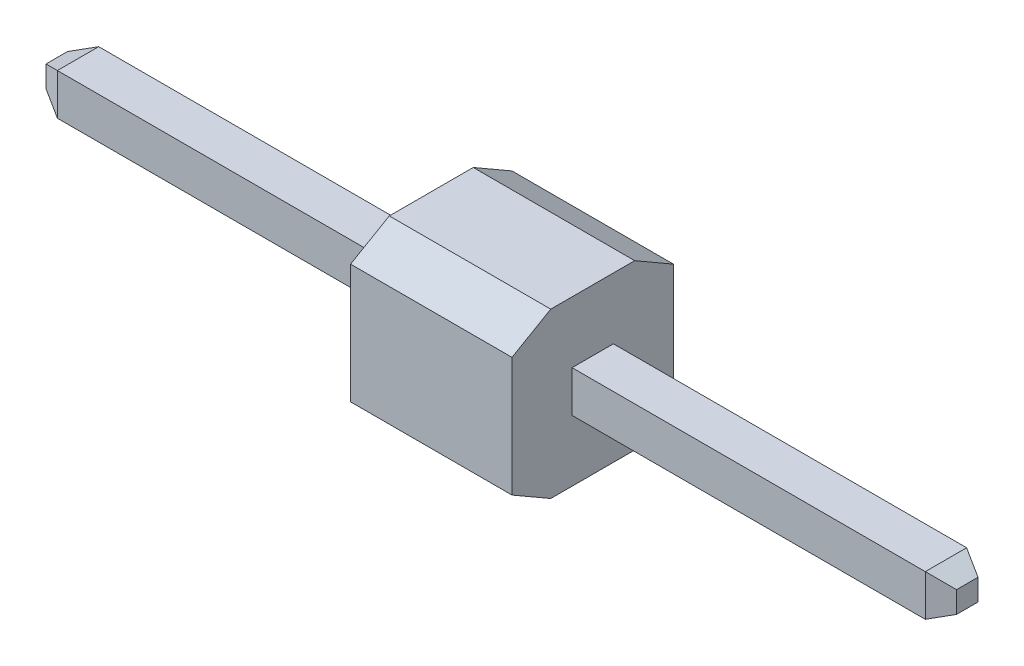
ISO-10303-21;
HEADER;
FILE_DESCRIPTION(('STEP AP214'),'2;1');
FILE_NAME('part.step','',(''),(''),'','','');
FILE_SCHEMA(('AUTOMOTIVE_DESIGN { 1 0 10303 214 1 1 1 1 }'));
ENDSEC;
DATA;
#1=APPLICATION_CONTEXT('core data for automotive mechanical design processes');
#2=APPLICATION_PROTOCOL_DEFINITION('international standard','automotive_design',2000,#1);
#3=PRODUCT_CONTEXT('',#1,'mechanical');
#4=PRODUCT('Part','Part','',(#3));
#5=PRODUCT_RELATED_PRODUCT_CATEGORY('part','',(#4));
#6=PRODUCT_DEFINITION_FORMATION('','',#4);
#7=PRODUCT_DEFINITION_CONTEXT('part definition',#1,'design');
#8=PRODUCT_DEFINITION('design','',#6,#7);
#9=PRODUCT_DEFINITION_SHAPE('','',#8);
#10=(LENGTH_UNIT() NAMED_UNIT(*) SI_UNIT(.MILLI.,.METRE.));
#11=(NAMED_UNIT(*) PLANE_ANGLE_UNIT() SI_UNIT($,.RADIAN.));
#12=(NAMED_UNIT(*) SI_UNIT($,.STERADIAN.) SOLID_ANGLE_UNIT());
#13=UNCERTAINTY_MEASURE_WITH_UNIT(LENGTH_MEASURE(1.E-05),#10,'distance_accuracy_value','');
#14=(GEOMETRIC_REPRESENTATION_CONTEXT(3) GLOBAL_UNCERTAINTY_ASSIGNED_CONTEXT((#13)) GLOBAL_UNIT_ASSIGNED_CONTEXT((#10,
#11,#12)) REPRESENTATION_CONTEXT('',''));
#15=CARTESIAN_POINT('',(0.,0.,0.));
#16=DIRECTION('',(0.,0.,1.));
#17=DIRECTION('',(1.,0.,0.));
#18=AXIS2_PLACEMENT_3D('',#15,#16,#17);
#19=CARTESIAN_POINT('',(5.42110070000193,2.85711572605714,-2.77112081761862));
#20=DIRECTION('',(1.,-9.93476518829084E-08,4.37113882867379E-08));
#21=DIRECTION('',(-9.93476589883358E-08,-1.,8.74227765734759E-08));
#22=AXIS2_PLACEMENT_3D('',#19,#20,#21);
#23=PLANE('',#22);
#24=DIRECTION('',(-1.18186632779335E-08,-0.50000007571054,-0.866025360072933));
#25=VECTOR('',#24,1.);
#26=CARTESIAN_POINT('',(5.42110050782732,1.61352602482091,-1.20112070890054));
#27=LINE('',#26,#25);
#28=CARTESIAN_POINT('',(5.42110050782732,1.61352602482091,-1.20112070890054));
#29=VERTEX_POINT('',#28);
#30=CARTESIAN_POINT('',(5.42110049963911,1.26711581085724,-1.8011206786164));
#31=VERTEX_POINT('',#30);
#32=EDGE_CURVE('E11',#29,#31,#27,.T.);
#33=ORIENTED_EDGE('',*,*,#32,.T.);
#34=DIRECTION('',(4.37113811813104E-08,-8.74227828590458E-08,-0.999999999999995));
#35=VECTOR('',#34,1.);
#36=CARTESIAN_POINT('',(5.42110049963911,1.26711581085724,-1.8011206786164));
#37=LINE('',#36,#35);
#38=CARTESIAN_POINT('',(5.4211005564639,1.26711569720762,-3.1011206786164));
#39=VERTEX_POINT('',#38);
#40=EDGE_CURVE('E304',#31,#39,#37,.T.);
#41=ORIENTED_EDGE('',*,*,#40,.T.);
#42=DIRECTION('',(8.75289963531795E-08,0.499999924289837,-0.866025447495713));
#43=VECTOR('',#42,1.);
#44=CARTESIAN_POINT('',(5.4211005564639,1.26711569720762,-3.1011206786164));
#45=LINE('',#44,#43);
#46=CARTESIAN_POINT('',(5.42110061710577,1.61352580626395,-3.70112070890054));
#47=VERTEX_POINT('',#46);
#48=EDGE_CURVE('E296',#39,#47,#45,.T.);
#49=ORIENTED_EDGE('',*,*,#48,.T.);
#50=DIRECTION('',(9.93476588436478E-08,0.999999999999991,-8.74227764822788E-08));
#51=VECTOR('',#50,1.);
#52=CARTESIAN_POINT('',(5.42110061710577,1.61352580626395,-3.70112070890054));
#53=LINE('',#52,#51);
#54=CARTESIAN_POINT('',(5.42110080061875,3.46070548323395,-3.70112087038612));
#55=VERTEX_POINT('',#54);
#56=EDGE_CURVE('E281',#47,#55,#53,.T.);
#57=ORIENTED_EDGE('',*,*,#56,.T.);
#58=DIRECTION('',(-1.18186619958731E-08,-0.500000075710537,-0.866025360072935));
#59=VECTOR('',#58,1.);
#60=CARTESIAN_POINT('',(5.42110080880696,3.80711569720762,-3.10112090067026));
#61=LINE('',#60,#59);
#62=CARTESIAN_POINT('',(5.42110080880696,3.80711569720762,-3.10112090067026));
#63=VERTEX_POINT('',#62);
#64=EDGE_CURVE('E265',#63,#55,#61,.T.);
#65=ORIENTED_EDGE('',*,*,#64,.F.);
#66=DIRECTION('',(4.37113811813104E-08,-8.74227814926175E-08,-0.999999999999995));
#67=VECTOR('',#66,1.);
#68=CARTESIAN_POINT('',(5.42110075198216,3.80711581085724,-1.80112090067026));
#69=LINE('',#68,#67);
#70=CARTESIAN_POINT('',(5.42110075198216,3.80711581085724,-1.80112090067026));
#71=VERTEX_POINT('',#70);
#72=EDGE_CURVE('E248',#71,#63,#69,.T.);
#73=ORIENTED_EDGE('',*,*,#72,.F.);
#74=DIRECTION('',(8.75289963525478E-08,0.499999924289836,-0.866025447495714));
#75=VECTOR('',#74,1.);
#76=CARTESIAN_POINT('',(5.4211006913403,3.46070570179091,-1.20112087038612));
#77=LINE('',#76,#75);
#78=CARTESIAN_POINT('',(5.4211006913403,3.46070570179091,-1.20112087038612));
#79=VERTEX_POINT('',#78);
#80=EDGE_CURVE('E242',#79,#71,#77,.T.);
#81=ORIENTED_EDGE('',*,*,#80,.F.);
#82=DIRECTION('',(9.93476588436478E-08,0.999999999999991,-8.74227763620714E-08));
#83=VECTOR('',#82,1.);
#84=CARTESIAN_POINT('',(5.42110050782732,1.61352602482091,-1.20112070890054));
#85=LINE('',#84,#83);
#86=EDGE_CURVE('E236',#29,#79,#85,.T.);
#87=ORIENTED_EDGE('',*,*,#86,.F.);
#88=EDGE_LOOP('',(#33,#41,#49,#57,#65,#73,#81,#87));
#89=FACE_BOUND('',#88,.T.);
#90=DIRECTION('',(-4.37113817364219E-08,8.74227801261891E-08,0.999999999999995));
#91=VECTOR('',#90,1.);
#92=CARTESIAN_POINT('',(5.42110063641942,2.21711572605714,-2.77112076166804));
#93=LINE('',#92,#91);
#94=CARTESIAN_POINT('',(5.42110063641942,2.21711572605714,-2.77112076166804));
#95=VERTEX_POINT('',#94);
#96=CARTESIAN_POINT('',(5.42110060844414,2.21711578200772,-2.13112076166804));
#97=VERTEX_POINT('',#96);
#98=EDGE_CURVE('E302',#95,#97,#93,.T.);
#99=ORIENTED_EDGE('',*,*,#98,.T.);
#100=DIRECTION('',(-9.93476592658908E-08,-0.999999999999991,8.7422776656742E-08));
#101=VECTOR('',#100,1.);
#102=CARTESIAN_POINT('',(5.42110067202664,2.85711578200772,-2.13112081761862));
#103=LINE('',#102,#101);
#104=CARTESIAN_POINT('',(5.42110067202664,2.85711578200772,-2.13112081761862));
#105=VERTEX_POINT('',#104);
#106=EDGE_CURVE('E293',#105,#97,#103,.T.);
#107=ORIENTED_EDGE('',*,*,#106,.F.);
#108=DIRECTION('',(-4.37113817364219E-08,8.74227829017466E-08,0.999999999999995));
#109=VECTOR('',#108,1.);
#110=CARTESIAN_POINT('',(5.42110070000193,2.85711572605714,-2.77112081761862));
#111=LINE('',#110,#109);
#112=CARTESIAN_POINT('',(5.42110070000193,2.85711572605714,-2.77112081761862));
#113=VERTEX_POINT('',#112);
#114=EDGE_CURVE('E278',#113,#105,#111,.T.);
#115=ORIENTED_EDGE('',*,*,#114,.F.);
#116=DIRECTION('',(-9.93476592658908E-08,-0.999999999999991,8.7422776656742E-08));
#117=VECTOR('',#116,1.);
#118=CARTESIAN_POINT('',(5.42110070000193,2.85711572605714,-2.77112081761862));
#119=LINE('',#118,#117);
#120=EDGE_CURVE('E263',#113,#95,#119,.T.);
#121=ORIENTED_EDGE('',*,*,#120,.T.);
#122=EDGE_LOOP('',(#99,#107,#115,#121));
#123=FACE_BOUND('',#122,.T.);
#124=ADVANCED_FACE('F17',(#89,#123),#23,.T.);
#125=CARTESIAN_POINT('',(2.92110070000193,2.85711597442627,-2.77112092689709));
#126=DIRECTION('',(1.,-9.93476518829084E-08,4.37113882867379E-08));
#127=DIRECTION('',(-9.93476589883358E-08,-1.,8.74227765734759E-08));
#128=AXIS2_PLACEMENT_3D('',#125,#126,#127);
#129=PLANE('',#128);
#130=DIRECTION('',(-1.18186632779335E-08,-0.50000007571054,-0.866025360072933));
#131=VECTOR('',#130,1.);
#132=CARTESIAN_POINT('',(2.92110050782732,1.61352627319004,-1.20112081817901));
#133=LINE('',#132,#131);
#134=CARTESIAN_POINT('',(2.92110050782732,1.61352627319004,-1.20112081817901));
#135=VERTEX_POINT('',#134);
#136=CARTESIAN_POINT('',(2.92110049963911,1.26711605922637,-1.80112078789487));
#137=VERTEX_POINT('',#136);
#138=EDGE_CURVE('E24',#135,#137,#133,.T.);
#139=ORIENTED_EDGE('',*,*,#138,.F.);
#140=DIRECTION('',(9.93476588436478E-08,0.999999999999991,-8.74227763620714E-08));
#141=VECTOR('',#140,1.);
#142=CARTESIAN_POINT('',(2.92110050782732,1.61352627319004,-1.20112081817901));
#143=LINE('',#142,#141);
#144=CARTESIAN_POINT('',(2.9211006913403,3.46070595016004,-1.20112097966459));
#145=VERTEX_POINT('',#144);
#146=EDGE_CURVE('E300',#135,#145,#143,.T.);
#147=ORIENTED_EDGE('',*,*,#146,.T.);
#148=DIRECTION('',(8.75289963525478E-08,0.499999924289836,-0.866025447495714));
#149=VECTOR('',#148,1.);
#150=CARTESIAN_POINT('',(2.9211006913403,3.46070595016004,-1.20112097966459));
#151=LINE('',#150,#149);
#152=CARTESIAN_POINT('',(2.92110075198216,3.80711605922637,-1.80112100994873));
#153=VERTEX_POINT('',#152);
#154=EDGE_CURVE('E286',#145,#153,#151,.T.);
#155=ORIENTED_EDGE('',*,*,#154,.T.);
#156=DIRECTION('',(4.37113811813104E-08,-8.74227814926175E-08,-0.999999999999995));
#157=VECTOR('',#156,1.);
#158=CARTESIAN_POINT('',(2.92110075198216,3.80711605922637,-1.80112100994873));
#159=LINE('',#158,#157);
#160=CARTESIAN_POINT('',(2.92110080880696,3.80711594557675,-3.10112100994873));
#161=VERTEX_POINT('',#160);
#162=EDGE_CURVE('E271',#153,#161,#159,.T.);
#163=ORIENTED_EDGE('',*,*,#162,.T.);
#164=DIRECTION('',(-1.18186626368607E-08,-0.500000075710537,-0.866025360072935));
#165=VECTOR('',#164,1.);
#166=CARTESIAN_POINT('',(2.92110080880696,3.80711594557675,-3.10112100994873));
#167=LINE('',#166,#165);
#168=CARTESIAN_POINT('',(2.92110080061875,3.46070573160308,-3.70112097966459));
#169=VERTEX_POINT('',#168);
#170=EDGE_CURVE('E253',#161,#169,#167,.T.);
#171=ORIENTED_EDGE('',*,*,#170,.T.);
#172=DIRECTION('',(9.93476588436478E-08,0.999999999999991,-8.74227764822788E-08));
#173=VECTOR('',#172,1.);
#174=CARTESIAN_POINT('',(2.92110061710577,1.61352605463308,-3.70112081817901));
#175=LINE('',#174,#173);
#176=CARTESIAN_POINT('',(2.92110061710577,1.61352605463308,-3.70112081817901));
#177=VERTEX_POINT('',#176);
#178=EDGE_CURVE('E261',#177,#169,#175,.T.);
#179=ORIENTED_EDGE('',*,*,#178,.F.);
#180=DIRECTION('',(8.75289963531795E-08,0.499999924289837,-0.866025447495713));
#181=VECTOR('',#180,1.);
#182=CARTESIAN_POINT('',(2.9211005564639,1.26711594557675,-3.10112078789487));
#183=LINE('',#182,#181);
#184=CARTESIAN_POINT('',(2.9211005564639,1.26711594557675,-3.10112078789487));
#185=VERTEX_POINT('',#184);
#186=EDGE_CURVE('E276',#185,#177,#183,.T.);
#187=ORIENTED_EDGE('',*,*,#186,.F.);
#188=DIRECTION('',(4.37113811813104E-08,-8.74227828590458E-08,-0.999999999999995));
#189=VECTOR('',#188,1.);
#190=CARTESIAN_POINT('',(2.92110049963911,1.26711605922637,-1.80112078789487));
#191=LINE('',#190,#189);
#192=EDGE_CURVE('E291',#137,#185,#191,.T.);
#193=ORIENTED_EDGE('',*,*,#192,.F.);
#194=EDGE_LOOP('',(#139,#147,#155,#163,#171,#179,#187,#193));
#195=FACE_BOUND('',#194,.T.);
#196=DIRECTION('',(-9.93476585720014E-08,-0.999999999999991,8.7422776656742E-08));
#197=VECTOR('',#196,1.);
#198=CARTESIAN_POINT('',(2.92110067202664,2.85711603037685,-2.13112092689709));
#199=LINE('',#198,#197);
#200=CARTESIAN_POINT('',(2.92110067202664,2.85711603037685,-2.13112092689709));
#201=VERTEX_POINT('',#200);
#202=CARTESIAN_POINT('',(2.92110060844414,2.21711603037685,-2.13112087094651));
#203=VERTEX_POINT('',#202);
#204=EDGE_CURVE('E298',#201,#203,#199,.T.);
#205=ORIENTED_EDGE('',*,*,#204,.T.);
#206=DIRECTION('',(-4.37113810425325E-08,8.74227801261891E-08,0.999999999999995));
#207=VECTOR('',#206,1.);
#208=CARTESIAN_POINT('',(2.92110063641942,2.21711597442627,-2.77112087094651));
#209=LINE('',#208,#207);
#210=CARTESIAN_POINT('',(2.92110063641942,2.21711597442627,-2.77112087094651));
#211=VERTEX_POINT('',#210);
#212=EDGE_CURVE('E283',#211,#203,#209,.T.);
#213=ORIENTED_EDGE('',*,*,#212,.F.);
#214=DIRECTION('',(-9.93476592658908E-08,-0.999999999999991,8.7422776656742E-08));
#215=VECTOR('',#214,1.);
#216=CARTESIAN_POINT('',(2.92110070000193,2.85711597442627,-2.77112092689709));
#217=LINE('',#216,#215);
#218=CARTESIAN_POINT('',(2.92110070000193,2.85711597442627,-2.77112092689709));
#219=VERTEX_POINT('',#218);
#220=EDGE_CURVE('E268',#219,#211,#217,.T.);
#221=ORIENTED_EDGE('',*,*,#220,.F.);
#222=DIRECTION('',(-4.37113817364219E-08,8.74227829017466E-08,0.999999999999995));
#223=VECTOR('',#222,1.);
#224=CARTESIAN_POINT('',(2.92110070000193,2.85711597442627,-2.77112092689709));
#225=LINE('',#224,#223);
#226=EDGE_CURVE('E251',#219,#201,#225,.T.);
#227=ORIENTED_EDGE('',*,*,#226,.T.);
#228=EDGE_LOOP('',(#205,#213,#221,#227));
#229=FACE_BOUND('',#228,.T.);
#230=ADVANCED_FACE('F314',(#195,#229),#129,.F.);
#231=CARTESIAN_POINT('',(5.42110050782732,1.61352602482091,-1.20112070890054));
#232=DIRECTION('',(1.07893287081065E-07,0.866025360072937,-0.500000075710535));
#233=DIRECTION('',(1.18186629566715E-08,0.500000075710542,0.866025360072941));
#234=AXIS2_PLACEMENT_3D('',#231,#232,#233);
#235=PLANE('',#234);
#236=ORIENTED_EDGE('',*,*,#138,.T.);
#237=DIRECTION('',(-0.999999999999994,9.93476511723651E-08,-4.37113884643734E-08));
#238=VECTOR('',#237,1.);
#239=CARTESIAN_POINT('',(5.42110049963911,1.26711581085724,-1.8011206786164));
#240=LINE('',#239,#238);
#241=EDGE_CURVE('E288',#31,#137,#240,.T.);
#242=ORIENTED_EDGE('',*,*,#241,.F.);
#243=ORIENTED_EDGE('',*,*,#32,.F.);
#244=DIRECTION('',(-0.999999999999994,9.93476518829078E-08,-4.3711388109102E-08));
#245=VECTOR('',#244,1.);
#246=CARTESIAN_POINT('',(5.42110050782732,1.61352602482091,-1.20112070890054));
#247=LINE('',#246,#245);
#248=EDGE_CURVE('E256',#29,#135,#247,.T.);
#249=ORIENTED_EDGE('',*,*,#248,.T.);
#250=EDGE_LOOP('',(#236,#242,#243,#249));
#251=FACE_BOUND('',#250,.T.);
#252=ADVANCED_FACE('F306',(#251),#235,.F.);
#253=CARTESIAN_POINT('',(5.42110049963911,1.26711581085724,-1.8011206786164));
#254=DIRECTION('',(9.93476589883358E-08,1.,-8.74227765734759E-08));
#255=DIRECTION('',(1.,-9.93476518829084E-08,4.37113882867379E-08));
#256=AXIS2_PLACEMENT_3D('',#253,#254,#255);
#257=PLANE('',#256);
#258=ORIENTED_EDGE('',*,*,#192,.T.);
#259=DIRECTION('',(-0.999999999999994,9.93476511723651E-08,-4.37113882867377E-08));
#260=VECTOR('',#259,1.);
#261=CARTESIAN_POINT('',(5.4211005564639,1.26711569720762,-3.1011206786164));
#262=LINE('',#261,#260);
#263=EDGE_CURVE('E273',#39,#185,#262,.T.);
#264=ORIENTED_EDGE('',*,*,#263,.F.);
#265=ORIENTED_EDGE('',*,*,#40,.F.);
#266=ORIENTED_EDGE('',*,*,#241,.T.);
#267=EDGE_LOOP('',(#258,#264,#265,#266));
#268=FACE_BOUND('',#267,.T.);
#269=ADVANCED_FACE('F311',(#268),#257,.F.);
#270=CARTESIAN_POINT('',(5.4211005564639,1.26711569720762,-3.1011206786164));
#271=DIRECTION('',(6.41819058997377E-08,0.866025447495721,0.499999924289845));
#272=DIRECTION('',(-8.7528996031702E-08,-0.499999924289838,0.866025447495717));
#273=AXIS2_PLACEMENT_3D('',#270,#271,#272);
#274=PLANE('',#273);
#275=ORIENTED_EDGE('',*,*,#186,.T.);
#276=DIRECTION('',(-0.999999999999994,9.93476518829078E-08,-4.37113882867377E-08));
#277=VECTOR('',#276,1.);
#278=CARTESIAN_POINT('',(5.42110061710577,1.61352580626395,-3.70112070890054));
#279=LINE('',#278,#277);
#280=EDGE_CURVE('E258',#47,#177,#279,.T.);
#281=ORIENTED_EDGE('',*,*,#280,.F.);
#282=ORIENTED_EDGE('',*,*,#48,.F.);
#283=ORIENTED_EDGE('',*,*,#263,.T.);
#284=EDGE_LOOP('',(#275,#281,#282,#283));
#285=FACE_BOUND('',#284,.T.);
#286=ADVANCED_FACE('F319',(#285),#274,.F.);
#287=CARTESIAN_POINT('',(5.42110061710577,1.61352580626395,-3.70112070890054));
#288=DIRECTION('',(-4.37113811813106E-08,8.74227836789032E-08,1.));
#289=DIRECTION('',(-1.,9.93476518829084E-08,-4.37113882867379E-08));
#290=AXIS2_PLACEMENT_3D('',#287,#288,#289);
#291=PLANE('',#290);
#292=ORIENTED_EDGE('',*,*,#178,.T.);
#293=DIRECTION('',(-0.999999999999994,9.93476518829078E-08,-4.37113884643734E-08));
#294=VECTOR('',#293,1.);
#295=CARTESIAN_POINT('',(5.42110080061875,3.46070548323395,-3.70112087038612));
#296=LINE('',#295,#294);
#297=EDGE_CURVE('E245',#55,#169,#296,.T.);
#298=ORIENTED_EDGE('',*,*,#297,.F.);
#299=ORIENTED_EDGE('',*,*,#56,.F.);
#300=ORIENTED_EDGE('',*,*,#280,.T.);
#301=EDGE_LOOP('',(#292,#298,#299,#300));
#302=FACE_BOUND('',#301,.T.);
#303=ADVANCED_FACE('F326',(#302),#291,.F.);
#304=CARTESIAN_POINT('',(5.42110080880696,3.80711569720762,-3.10112090067026));
#305=DIRECTION('',(1.07893287081065E-07,0.866025360072937,-0.500000075710535));
#306=DIRECTION('',(1.18186629566715E-08,0.500000075710542,0.866025360072941));
#307=AXIS2_PLACEMENT_3D('',#304,#305,#306);
#308=PLANE('',#307);
#309=ORIENTED_EDGE('',*,*,#170,.F.);
#310=DIRECTION('',(-0.999999999999994,9.93476504618223E-08,-4.37113882867377E-08));
#311=VECTOR('',#310,1.);
#312=CARTESIAN_POINT('',(5.42110080880696,3.80711569720762,-3.10112090067026));
#313=LINE('',#312,#311);
#314=EDGE_CURVE('E239',#63,#161,#313,.T.);
#315=ORIENTED_EDGE('',*,*,#314,.F.);
#316=ORIENTED_EDGE('',*,*,#64,.T.);
#317=ORIENTED_EDGE('',*,*,#297,.T.);
#318=EDGE_LOOP('',(#309,#315,#316,#317));
#319=FACE_BOUND('',#318,.T.);
#320=ADVANCED_FACE('F329',(#319),#308,.T.);
#321=CARTESIAN_POINT('',(5.42110075198216,3.80711581085724,-1.80112090067026));
#322=DIRECTION('',(9.93476589883358E-08,1.,-8.74227765734759E-08));
#323=DIRECTION('',(1.,-9.93476518829084E-08,4.37113882867379E-08));
#324=AXIS2_PLACEMENT_3D('',#321,#322,#323);
#325=PLANE('',#324);
#326=ORIENTED_EDGE('',*,*,#162,.F.);
#327=DIRECTION('',(-0.999999999999994,9.93476504618223E-08,-4.37113883755555E-08));
#328=VECTOR('',#327,1.);
#329=CARTESIAN_POINT('',(5.42110075198216,3.80711581085724,-1.80112090067026));
#330=LINE('',#329,#328);
#331=EDGE_CURVE('E233',#71,#153,#330,.T.);
#332=ORIENTED_EDGE('',*,*,#331,.F.);
#333=ORIENTED_EDGE('',*,*,#72,.T.);
#334=ORIENTED_EDGE('',*,*,#314,.T.);
#335=EDGE_LOOP('',(#326,#332,#333,#334));
#336=FACE_BOUND('',#335,.T.);
#337=ADVANCED_FACE('F333',(#336),#325,.T.);
#338=CARTESIAN_POINT('',(5.4211006913403,3.46070570179091,-1.20112087038612));
#339=DIRECTION('',(6.41819058997377E-08,0.866025447495721,0.499999924289845));
#340=DIRECTION('',(-8.7528996031702E-08,-0.499999924289838,0.866025447495717));
#341=AXIS2_PLACEMENT_3D('',#338,#339,#340);
#342=PLANE('',#341);
#343=ORIENTED_EDGE('',*,*,#154,.F.);
#344=DIRECTION('',(-0.999999999999994,9.93476518829078E-08,-4.3711388109102E-08));
#345=VECTOR('',#344,1.);
#346=CARTESIAN_POINT('',(5.4211006913403,3.46070570179091,-1.20112087038612));
#347=LINE('',#346,#345);
#348=EDGE_CURVE('E230',#79,#145,#347,.T.);
#349=ORIENTED_EDGE('',*,*,#348,.F.);
#350=ORIENTED_EDGE('',*,*,#80,.T.);
#351=ORIENTED_EDGE('',*,*,#331,.T.);
#352=EDGE_LOOP('',(#343,#349,#350,#351));
#353=FACE_BOUND('',#352,.T.);
#354=ADVANCED_FACE('F337',(#353),#342,.T.);
#355=CARTESIAN_POINT('',(5.42110050782732,1.61352602482091,-1.20112070890054));
#356=DIRECTION('',(-4.37113811813106E-08,8.74227835615132E-08,1.));
#357=DIRECTION('',(-9.93476589883358E-08,-1.,8.74227764560859E-08));
#358=AXIS2_PLACEMENT_3D('',#355,#356,#357);
#359=PLANE('',#358);
#360=ORIENTED_EDGE('',*,*,#146,.F.);
#361=ORIENTED_EDGE('',*,*,#248,.F.);
#362=ORIENTED_EDGE('',*,*,#86,.T.);
#363=ORIENTED_EDGE('',*,*,#348,.T.);
#364=EDGE_LOOP('',(#360,#361,#362,#363));
#365=FACE_BOUND('',#364,.T.);
#366=ADVANCED_FACE('F339',(#365),#359,.T.);
#367=CARTESIAN_POINT('',(-2.87889929999807,2.85711655064265,-2.77112118042314));
#368=DIRECTION('',(-1.,9.93476518829084E-08,-4.37113882867379E-08));
#369=DIRECTION('',(9.93476589883358E-08,1.,-8.74227765734759E-08));
#370=AXIS2_PLACEMENT_3D('',#367,#368,#369);
#371=PLANE('',#370);
#372=DIRECTION('',(9.93476554744631E-08,0.999999999999991,-8.74227761415115E-08));
#373=VECTOR('',#372,1.);
#374=CARTESIAN_POINT('',(-2.87889936954172,2.37099812033048,-2.28500266511631));
#375=LINE('',#374,#373);
#376=CARTESIAN_POINT('',(-2.87889936954172,2.37099812033048,-2.28500266511631));
#377=VERTEX_POINT('',#376);
#378=CARTESIAN_POINT('',(-2.87889933653475,2.70323506594048,-2.28500269416139));
#379=VERTEX_POINT('',#378);
#380=EDGE_CURVE('E228',#377,#379,#375,.T.);
#381=ORIENTED_EDGE('',*,*,#380,.T.);
#382=DIRECTION('',(4.37113820547149E-08,-8.74227694560864E-08,-0.999999999999995));
#383=VECTOR('',#382,1.);
#384=CARTESIAN_POINT('',(-2.87889933653475,2.70323506594048,-2.28500269416139));
#385=LINE('',#384,#383);
#386=CARTESIAN_POINT('',(-2.87889932201222,2.7032350368954,-2.61723963977939));
#387=VERTEX_POINT('',#386);
#388=EDGE_CURVE('E223',#379,#387,#385,.T.);
#389=ORIENTED_EDGE('',*,*,#388,.T.);
#390=DIRECTION('',(-9.93476634944484E-08,-0.999999999999991,8.7422776141512E-08));
#391=VECTOR('',#390,1.);
#392=CARTESIAN_POINT('',(-2.87889932201222,2.7032350368954,-2.61723963977939));
#393=LINE('',#392,#391);
#394=CARTESIAN_POINT('',(-2.87889935501918,2.3709980912854,-2.61723961073432));
#395=VERTEX_POINT('',#394);
#396=EDGE_CURVE('E215',#387,#395,#393,.T.);
#397=ORIENTED_EDGE('',*,*,#396,.T.);
#398=DIRECTION('',(-4.37113740347301E-08,8.74227801493995E-08,0.999999999999995));
#399=VECTOR('',#398,1.);
#400=CARTESIAN_POINT('',(-2.87889935501918,2.3709980912854,-2.61723961073432));
#401=LINE('',#400,#399);
#402=EDGE_CURVE('E207',#395,#377,#401,.T.);
#403=ORIENTED_EDGE('',*,*,#402,.T.);
#404=EDGE_LOOP('',(#381,#389,#397,#403));
#405=FACE_BOUND('',#404,.T.);
#406=ADVANCED_FACE('F341',(#405),#371,.T.);
#407=CARTESIAN_POINT('',(-2.87889929999807,2.85711655064265,-2.77112118042314));
#408=DIRECTION('',(9.93476589883358E-08,1.,-8.74227764510112E-08));
#409=DIRECTION('',(-4.37113811813106E-08,8.74227835564385E-08,1.));
#410=AXIS2_PLACEMENT_3D('',#407,#408,#409);
#411=PLANE('',#410);
#412=DIRECTION('',(0.999999999999994,-9.93476527532252E-08,4.37113882769953E-08));
#413=VECTOR('',#412,1.);
#414=CARTESIAN_POINT('',(-2.54889929999807,2.85711651785793,-2.77112116599838));
#415=LINE('',#414,#413);
#416=CARTESIAN_POINT('',(-2.54889929999807,2.85711651785793,-2.77112116599838));
#417=VERTEX_POINT('',#416);
#418=EDGE_CURVE('E225',#417,#219,#415,.T.);
#419=ORIENTED_EDGE('',*,*,#418,.F.);
#420=DIRECTION('',(-4.37113817364219E-08,8.74227829017466E-08,0.999999999999995));
#421=VECTOR('',#420,1.);
#422=CARTESIAN_POINT('',(-2.54889929999807,2.85711651785793,-2.77112116599838));
#423=LINE('',#422,#421);
#424=CARTESIAN_POINT('',(-2.54889932797336,2.85711657380851,-2.13112116599838));
#425=VERTEX_POINT('',#424);
#426=EDGE_CURVE('E217',#417,#425,#423,.T.);
#427=ORIENTED_EDGE('',*,*,#426,.T.);
#428=DIRECTION('',(0.999999999999994,-9.93476527532252E-08,4.3711388195809E-08));
#429=VECTOR('',#428,1.);
#430=CARTESIAN_POINT('',(-2.54889932797336,2.85711657380851,-2.13112116599838));
#431=LINE('',#430,#429);
#432=EDGE_CURVE('E220',#425,#201,#431,.T.);
#433=ORIENTED_EDGE('',*,*,#432,.T.);
#434=ORIENTED_EDGE('',*,*,#226,.F.);
#435=EDGE_LOOP('',(#419,#427,#433,#434));
#436=FACE_BOUND('',#435,.T.);
#437=ADVANCED_FACE('F348',(#436),#411,.T.);
#438=CARTESIAN_POINT('',(-2.87889932797336,2.85711660659323,-2.13112118042314));
#439=DIRECTION('',(-4.37113811813106E-08,8.74227836789032E-08,1.));
#440=DIRECTION('',(-1.,9.93476518829084E-08,-4.37113882867379E-08));
#441=AXIS2_PLACEMENT_3D('',#438,#439,#440);
#442=PLANE('',#441);
#443=ORIENTED_EDGE('',*,*,#432,.F.);
#444=DIRECTION('',(-9.93476592658908E-08,-0.999999999999991,8.74227759628526E-08));
#445=VECTOR('',#444,1.);
#446=CARTESIAN_POINT('',(-2.54889932797336,2.85711657380851,-2.13112116599838));
#447=LINE('',#446,#445);
#448=CARTESIAN_POINT('',(-2.54889939155586,2.21711657380851,-2.13112111004781));
#449=VERTEX_POINT('',#448);
#450=EDGE_CURVE('E209',#425,#449,#447,.T.);
#451=ORIENTED_EDGE('',*,*,#450,.T.);
#452=DIRECTION('',(0.999999999999994,-9.93476524284799E-08,4.37113882769953E-08));
#453=VECTOR('',#452,1.);
#454=CARTESIAN_POINT('',(-2.54889939155586,2.2171165738085,-2.13112111004781));
#455=LINE('',#454,#453);
#456=EDGE_CURVE('E212',#449,#203,#455,.T.);
#457=ORIENTED_EDGE('',*,*,#456,.T.);
#458=ORIENTED_EDGE('',*,*,#204,.F.);
#459=EDGE_LOOP('',(#443,#451,#457,#458));
#460=FACE_BOUND('',#459,.T.);
#461=ADVANCED_FACE('F424',(#460),#442,.T.);
#462=CARTESIAN_POINT('',(-2.87889936358058,2.21711655064265,-2.77112112447256));
#463=DIRECTION('',(9.93476589883357E-08,1.,-8.74227764040693E-08));
#464=DIRECTION('',(-4.37113811813106E-08,8.74227835094966E-08,1.));
#465=AXIS2_PLACEMENT_3D('',#462,#463,#464);
#466=PLANE('',#465);
#467=ORIENTED_EDGE('',*,*,#456,.F.);
#468=DIRECTION('',(4.37113831242007E-08,-8.74227884528619E-08,-0.999999999999995));
#469=VECTOR('',#468,1.);
#470=CARTESIAN_POINT('',(-2.54889939155586,2.21711657380851,-2.13112111004781));
#471=LINE('',#470,#469);
#472=CARTESIAN_POINT('',(-2.54889936358058,2.21711651785792,-2.77112111004781));
#473=VERTEX_POINT('',#472);
#474=EDGE_CURVE('E201',#449,#473,#471,.T.);
#475=ORIENTED_EDGE('',*,*,#474,.T.);
#476=DIRECTION('',(0.999999999999994,-9.93476524284799E-08,4.37113882769953E-08));
#477=VECTOR('',#476,1.);
#478=CARTESIAN_POINT('',(-2.54889936358058,2.21711651785792,-2.77112111004781));
#479=LINE('',#478,#477);
#480=EDGE_CURVE('E204',#473,#211,#479,.T.);
#481=ORIENTED_EDGE('',*,*,#480,.T.);
#482=ORIENTED_EDGE('',*,*,#212,.T.);
#483=EDGE_LOOP('',(#467,#475,#481,#482));
#484=FACE_BOUND('',#483,.T.);
#485=ADVANCED_FACE('F421',(#484),#466,.F.);
#486=CARTESIAN_POINT('',(-2.87889929999807,2.85711655064265,-2.77112118042314));
#487=DIRECTION('',(-4.37113811813106E-08,8.74227836789032E-08,1.));
#488=DIRECTION('',(-1.,9.93476518829084E-08,-4.37113882867379E-08));
#489=AXIS2_PLACEMENT_3D('',#486,#487,#488);
#490=PLANE('',#489);
#491=ORIENTED_EDGE('',*,*,#480,.F.);
#492=DIRECTION('',(9.93476606536696E-08,0.999999999999991,-8.7422776656742E-08));
#493=VECTOR('',#492,1.);
#494=CARTESIAN_POINT('',(-2.54889936358058,2.21711651785793,-2.77112111004781));
#495=LINE('',#494,#493);
#496=EDGE_CURVE('E196',#473,#417,#495,.T.);
#497=ORIENTED_EDGE('',*,*,#496,.T.);
#498=ORIENTED_EDGE('',*,*,#418,.T.);
#499=ORIENTED_EDGE('',*,*,#220,.T.);
#500=EDGE_LOOP('',(#491,#497,#498,#499));
#501=FACE_BOUND('',#500,.T.);
#502=ADVANCED_FACE('F376',(#501),#490,.F.);
#503=CARTESIAN_POINT('',(-2.87889929999807,2.85711655064265,-2.77112118042314));
#504=DIRECTION('',(-4.37113811813106E-08,8.74227836789032E-08,1.));
#505=DIRECTION('',(-1.,9.93476518829084E-08,-4.37113882867379E-08));
#506=AXIS2_PLACEMENT_3D('',#503,#504,#505);
#507=PLANE('',#506);
#508=DIRECTION('',(0.999999999999994,-9.93476569749143E-08,4.37113882769953E-08));
#509=VECTOR('',#508,1.);
#510=CARTESIAN_POINT('',(5.42110070000193,2.85711572605715,-2.77112081761862));
#511=LINE('',#510,#509);
#512=CARTESIAN_POINT('',(10.8911007000019,2.85711518262548,-2.77112057851732));
#513=VERTEX_POINT('',#512);
#514=EDGE_CURVE('E199',#113,#513,#511,.T.);
#515=ORIENTED_EDGE('',*,*,#514,.T.);
#516=DIRECTION('',(-9.93476606536696E-08,-0.999999999999991,8.7422776656742E-08));
#517=VECTOR('',#516,1.);
#518=CARTESIAN_POINT('',(10.8911007000019,2.85711518262548,-2.77112057851732));
#519=LINE('',#518,#517);
#520=CARTESIAN_POINT('',(10.8911006364194,2.21711518262548,-2.77112052256675));
#521=VERTEX_POINT('',#520);
#522=EDGE_CURVE('E191',#513,#521,#519,.T.);
#523=ORIENTED_EDGE('',*,*,#522,.T.);
#524=DIRECTION('',(0.999999999999994,-9.93476465830644E-08,4.37113882769953E-08));
#525=VECTOR('',#524,1.);
#526=CARTESIAN_POINT('',(5.42110063641942,2.21711572605713,-2.77112076166804));
#527=LINE('',#526,#525);
#528=EDGE_CURVE('E194',#95,#521,#527,.T.);
#529=ORIENTED_EDGE('',*,*,#528,.F.);
#530=ORIENTED_EDGE('',*,*,#120,.F.);
#531=EDGE_LOOP('',(#515,#523,#529,#530));
#532=FACE_BOUND('',#531,.T.);
#533=ADVANCED_FACE('F367',(#532),#507,.F.);
#534=CARTESIAN_POINT('',(-2.87889936358058,2.21711655064265,-2.77112112447256));
#535=DIRECTION('',(9.93476589883357E-08,1.,-8.74227764040693E-08));
#536=DIRECTION('',(-4.37113811813106E-08,8.74227835094966E-08,1.));
#537=AXIS2_PLACEMENT_3D('',#534,#535,#536);
#538=PLANE('',#537);
#539=ORIENTED_EDGE('',*,*,#528,.T.);
#540=DIRECTION('',(-4.37113817364219E-08,8.74227801261892E-08,0.999999999999995));
#541=VECTOR('',#540,1.);
#542=CARTESIAN_POINT('',(10.8911006364194,2.21711518262548,-2.77112052256675));
#543=LINE('',#542,#541);
#544=CARTESIAN_POINT('',(10.8911006084441,2.21711523857607,-2.13112052256675));
#545=VERTEX_POINT('',#544);
#546=EDGE_CURVE('E186',#521,#545,#543,.T.);
#547=ORIENTED_EDGE('',*,*,#546,.T.);
#548=DIRECTION('',(0.999999999999994,-9.93476465830644E-08,4.37113881146227E-08));
#549=VECTOR('',#548,1.);
#550=CARTESIAN_POINT('',(5.42110060844414,2.21711578200772,-2.13112076166804));
#551=LINE('',#550,#549);
#552=EDGE_CURVE('E189',#97,#545,#551,.T.);
#553=ORIENTED_EDGE('',*,*,#552,.F.);
#554=ORIENTED_EDGE('',*,*,#98,.F.);
#555=EDGE_LOOP('',(#539,#547,#553,#554));
#556=FACE_BOUND('',#555,.T.);
#557=ADVANCED_FACE('F364',(#556),#538,.F.);
#558=CARTESIAN_POINT('',(-2.87889932797336,2.85711660659323,-2.13112118042314));
#559=DIRECTION('',(-4.37113811813106E-08,8.74227836789032E-08,1.));
#560=DIRECTION('',(-1.,9.93476518829084E-08,-4.37113882867379E-08));
#561=AXIS2_PLACEMENT_3D('',#558,#559,#560);
#562=PLANE('',#561);
#563=ORIENTED_EDGE('',*,*,#552,.T.);
#564=DIRECTION('',(9.93476578781121E-08,0.999999999999991,-8.74227759628526E-08));
#565=VECTOR('',#564,1.);
#566=CARTESIAN_POINT('',(10.8911006084441,2.21711523857607,-2.13112052256675));
#567=LINE('',#566,#565);
#568=CARTESIAN_POINT('',(10.8911006720266,2.85711523857607,-2.13112057851732));
#569=VERTEX_POINT('',#568);
#570=EDGE_CURVE('E176',#545,#569,#567,.T.);
#571=ORIENTED_EDGE('',*,*,#570,.T.);
#572=DIRECTION('',(0.999999999999994,-9.93476569749143E-08,4.37113881146227E-08));
#573=VECTOR('',#572,1.);
#574=CARTESIAN_POINT('',(5.42110067202664,2.85711578200773,-2.13112081761862));
#575=LINE('',#574,#573);
#576=EDGE_CURVE('E179',#105,#569,#575,.T.);
#577=ORIENTED_EDGE('',*,*,#576,.F.);
#578=ORIENTED_EDGE('',*,*,#106,.T.);
#579=EDGE_LOOP('',(#563,#571,#577,#578));
#580=FACE_BOUND('',#579,.T.);
#581=ADVANCED_FACE('F366',(#580),#562,.T.);
#582=CARTESIAN_POINT('',(-2.87889929999807,2.85711655064265,-2.77112118042314));
#583=DIRECTION('',(9.93476589883358E-08,1.,-8.74227764510112E-08));
#584=DIRECTION('',(-4.37113811813106E-08,8.74227835564385E-08,1.));
#585=AXIS2_PLACEMENT_3D('',#582,#583,#584);
#586=PLANE('',#585);
#587=ORIENTED_EDGE('',*,*,#576,.T.);
#588=DIRECTION('',(4.37113817364219E-08,-8.74227829017466E-08,-0.999999999999995));
#589=VECTOR('',#588,1.);
#590=CARTESIAN_POINT('',(10.8911006720266,2.85711523857607,-2.13112057851732));
#591=LINE('',#590,#589);
#592=EDGE_CURVE('E167',#569,#513,#591,.T.);
#593=ORIENTED_EDGE('',*,*,#592,.T.);
#594=ORIENTED_EDGE('',*,*,#514,.F.);
#595=ORIENTED_EDGE('',*,*,#114,.T.);
#596=EDGE_LOOP('',(#587,#593,#594,#595));
#597=FACE_BOUND('',#596,.T.);
#598=ADVANCED_FACE('F373',(#597),#586,.T.);
#599=CARTESIAN_POINT('',(11.2211007000019,2.85711514984076,-2.77112056409257));
#600=DIRECTION('',(-1.,9.93476518829084E-08,-4.37113882867379E-08));
#601=DIRECTION('',(9.93476589883358E-08,1.,-8.74227765734759E-08));
#602=AXIS2_PLACEMENT_3D('',#599,#600,#601);
#603=PLANE('',#602);
#604=DIRECTION('',(-9.93476581477919E-08,-0.999999999999991,8.7422776141512E-08));
#605=VECTOR('',#604,1.);
#606=CARTESIAN_POINT('',(11.2211006634652,2.70323366513859,-2.28500207783082));
#607=LINE('',#606,#605);
#608=CARTESIAN_POINT('',(11.2211006634652,2.70323366513859,-2.28500207783082));
#609=VERTEX_POINT('',#608);
#610=CARTESIAN_POINT('',(11.2211006304583,2.37099671952859,-2.28500204878574));
#611=VERTEX_POINT('',#610);
#612=EDGE_CURVE('E153',#609,#611,#607,.T.);
#613=ORIENTED_EDGE('',*,*,#612,.T.);
#614=DIRECTION('',(4.37113820547149E-08,-8.74227854960561E-08,-0.999999999999995));
#615=VECTOR('',#614,1.);
#616=CARTESIAN_POINT('',(11.2211006304583,2.37099671952859,-2.28500204878574));
#617=LINE('',#616,#615);
#618=CARTESIAN_POINT('',(11.2211006449808,2.37099669048351,-2.61723899440374));
#619=VERTEX_POINT('',#618);
#620=EDGE_CURVE('E395',#611,#619,#617,.T.);
#621=ORIENTED_EDGE('',*,*,#620,.T.);
#622=DIRECTION('',(9.93476581477913E-08,0.999999999999991,-8.74227761415115E-08));
#623=VECTOR('',#622,1.);
#624=CARTESIAN_POINT('',(11.2211006449808,2.37099669048351,-2.61723899440374));
#625=LINE('',#624,#623);
#626=CARTESIAN_POINT('',(11.2211006779878,2.70323363609351,-2.61723902344882));
#627=VERTEX_POINT('',#626);
#628=EDGE_CURVE('E156',#619,#627,#625,.T.);
#629=ORIENTED_EDGE('',*,*,#628,.T.);
#630=DIRECTION('',(-4.37113874013715E-08,8.74227801493995E-08,0.999999999999995));
#631=VECTOR('',#630,1.);
#632=CARTESIAN_POINT('',(11.2211006779878,2.70323363609351,-2.61723902344882));
#633=LINE('',#632,#631);
#634=EDGE_CURVE('E149',#627,#609,#633,.T.);
#635=ORIENTED_EDGE('',*,*,#634,.T.);
#636=EDGE_LOOP('',(#613,#621,#629,#635));
#637=FACE_BOUND('',#636,.T.);
#638=ADVANCED_FACE('F151',(#637),#603,.F.);
#639=CARTESIAN_POINT('',(-2.87889934829281,2.37099807783265,-2.77112113792532));
#640=DIRECTION('',(-0.422618351780369,-0.906307745050466,6.07587120833484E-08));
#641=DIRECTION('',(4.37113811813106E-08,-8.74227835094966E-08,-1.));
#642=AXIS2_PLACEMENT_3D('',#639,#640,#641);
#643=PLANE('',#642);
#644=DIRECTION('',(0.834817073788749,-0.389281669540041,0.389281691158098));
#645=VECTOR('',#644,1.);
#646=CARTESIAN_POINT('',(-2.87889936954173,2.37099812032996,-2.2850026651168));
#647=LINE('',#646,#645);
#648=EDGE_CURVE('E181',#377,#449,#647,.T.);
#649=ORIENTED_EDGE('',*,*,#648,.F.);
#650=ORIENTED_EDGE('',*,*,#402,.F.);
#651=DIRECTION('',(-0.834817107820821,0.389281737604208,0.389281550111906));
#652=VECTOR('',#651,1.);
#653=CARTESIAN_POINT('',(-2.54889936358101,2.21711651785646,-2.77112111004727));
#654=LINE('',#653,#652);
#655=EDGE_CURVE('E404',#473,#395,#654,.T.);
#656=ORIENTED_EDGE('',*,*,#655,.F.);
#657=ORIENTED_EDGE('',*,*,#474,.F.);
#658=EDGE_LOOP('',(#649,#650,#656,#657));
#659=FACE_BOUND('',#658,.T.);
#660=ADVANCED_FACE('F418',(#659),#643,.T.);
#661=CARTESIAN_POINT('',(-2.87889930672445,2.8571165640954,-2.61723965323214));
#662=DIRECTION('',(-0.422618222124847,-3.72458176658199E-08,-0.906307805509828));
#663=DIRECTION('',(9.93476589883358E-08,1.,-8.74227765734759E-08));
#664=AXIS2_PLACEMENT_3D('',#661,#662,#663);
#665=PLANE('',#664);
#666=ORIENTED_EDGE('',*,*,#655,.T.);
#667=ORIENTED_EDGE('',*,*,#396,.F.);
#668=DIRECTION('',(-0.834817185169259,-0.389281503665791,0.389281618176066));
#669=VECTOR('',#668,1.);
#670=CARTESIAN_POINT('',(-2.54889929999693,2.85711651785519,-2.77112116599866));
#671=LINE('',#670,#669);
#672=EDGE_CURVE('E160',#417,#387,#671,.T.);
#673=ORIENTED_EDGE('',*,*,#672,.F.);
#674=ORIENTED_EDGE('',*,*,#496,.F.);
#675=EDGE_LOOP('',(#666,#667,#673,#674));
#676=FACE_BOUND('',#675,.T.);
#677=ADVANCED_FACE('F434',(#676),#665,.T.);
#678=CARTESIAN_POINT('',(-2.54889932797336,2.85711657380851,-2.13112116599838));
#679=DIRECTION('',(0.422618301356777,-1.21218081559392E-07,-0.906307768563367));
#680=DIRECTION('',(-9.93476589883358E-08,-1.,8.74227765734759E-08));
#681=AXIS2_PLACEMENT_3D('',#678,#679,#680);
#682=PLANE('',#681);
#683=ORIENTED_EDGE('',*,*,#648,.T.);
#684=ORIENTED_EDGE('',*,*,#450,.F.);
#685=DIRECTION('',(0.834817151137183,0.389281571729959,0.389281623093937));
#686=VECTOR('',#685,1.);
#687=CARTESIAN_POINT('',(-2.87889933653759,2.70323506594802,-2.28500269416285));
#688=LINE('',#687,#686);
#689=EDGE_CURVE('E170',#379,#425,#688,.T.);
#690=ORIENTED_EDGE('',*,*,#689,.F.);
#691=ORIENTED_EDGE('',*,*,#380,.F.);
#692=EDGE_LOOP('',(#683,#684,#690,#691));
#693=FACE_BOUND('',#692,.T.);
#694=ADVANCED_FACE('F413',(#693),#682,.F.);
#695=CARTESIAN_POINT('',(-2.54889929999807,2.85711651785793,-2.77112116599838));
#696=DIRECTION('',(0.422618171701255,-0.906307829022729,9.770517399793E-08));
#697=DIRECTION('',(-4.37113811813106E-08,8.74227835564385E-08,1.));
#698=AXIS2_PLACEMENT_3D('',#695,#696,#697);
#699=PLANE('',#698);
#700=ORIENTED_EDGE('',*,*,#672,.T.);
#701=ORIENTED_EDGE('',*,*,#388,.F.);
#702=ORIENTED_EDGE('',*,*,#689,.T.);
#703=ORIENTED_EDGE('',*,*,#426,.F.);
#704=EDGE_LOOP('',(#700,#701,#702,#703));
#705=FACE_BOUND('',#704,.T.);
#706=ADVANCED_FACE('F429',(#705),#699,.F.);
#707=CARTESIAN_POINT('',(11.2211006847142,2.70323362264076,-2.77112055063982));
#708=DIRECTION('',(0.422618351780369,0.906307745050466,-6.07587121258922E-08));
#709=DIRECTION('',(4.37113811813106E-08,-8.74227835564385E-08,-1.));
#710=AXIS2_PLACEMENT_3D('',#707,#708,#709);
#711=PLANE('',#710);
#712=DIRECTION('',(-0.834817107820823,0.389281737604205,0.389281550111903));
#713=VECTOR('',#712,1.);
#714=CARTESIAN_POINT('',(11.2211006634653,2.70323366513911,-2.2850020778313));
#715=LINE('',#714,#713);
#716=EDGE_CURVE('E164',#609,#569,#715,.T.);
#717=ORIENTED_EDGE('',*,*,#716,.F.);
#718=ORIENTED_EDGE('',*,*,#634,.F.);
#719=DIRECTION('',(0.834817073788749,-0.38928166954004,0.389281691158099));
#720=VECTOR('',#719,1.);
#721=CARTESIAN_POINT('',(10.8911007000019,2.85711518262548,-2.77112057851732));
#722=LINE('',#721,#720);
#723=EDGE_CURVE('E392',#513,#627,#722,.T.);
#724=ORIENTED_EDGE('',*,*,#723,.F.);
#725=ORIENTED_EDGE('',*,*,#592,.F.);
#726=EDGE_LOOP('',(#717,#718,#724,#725));
#727=FACE_BOUND('',#726,.T.);
#728=ADVANCED_FACE('F165',(#727),#711,.T.);
#729=CARTESIAN_POINT('',(10.8911007000019,2.85711518262548,-2.77112057851732));
#730=DIRECTION('',(-0.422618301356777,1.21218081559392E-07,0.906307768563367));
#731=DIRECTION('',(-9.93476589883358E-08,-1.,8.74227765734759E-08));
#732=AXIS2_PLACEMENT_3D('',#729,#730,#731);
#733=PLANE('',#732);
#734=ORIENTED_EDGE('',*,*,#723,.T.);
#735=ORIENTED_EDGE('',*,*,#628,.F.);
#736=DIRECTION('',(0.834817151137181,0.389281571729965,0.389281623093935));
#737=VECTOR('',#736,1.);
#738=CARTESIAN_POINT('',(10.891100636421,2.21711518262128,-2.77112052256585));
#739=LINE('',#738,#737);
#740=EDGE_CURVE('E389',#521,#619,#739,.T.);
#741=ORIENTED_EDGE('',*,*,#740,.F.);
#742=ORIENTED_EDGE('',*,*,#522,.F.);
#743=EDGE_LOOP('',(#734,#735,#741,#742));
#744=FACE_BOUND('',#743,.T.);
#745=ADVANCED_FACE('F390',(#744),#733,.F.);
#746=CARTESIAN_POINT('',(11.221100678753,2.85711519233859,-2.28500209128357));
#747=DIRECTION('',(0.422618222124847,3.72458176658199E-08,0.906307805509828));
#748=DIRECTION('',(9.93476589883358E-08,1.,-8.74227765734759E-08));
#749=AXIS2_PLACEMENT_3D('',#746,#747,#748);
#750=PLANE('',#749);
#751=ORIENTED_EDGE('',*,*,#716,.T.);
#752=ORIENTED_EDGE('',*,*,#570,.F.);
#753=DIRECTION('',(-0.834817185169258,-0.389281503665792,0.389281618176066));
#754=VECTOR('',#753,1.);
#755=CARTESIAN_POINT('',(11.2211006304583,2.37099671952807,-2.28500204878622));
#756=LINE('',#755,#754);
#757=EDGE_CURVE('E175',#611,#545,#756,.T.);
#758=ORIENTED_EDGE('',*,*,#757,.F.);
#759=ORIENTED_EDGE('',*,*,#612,.F.);
#760=EDGE_LOOP('',(#751,#752,#758,#759));
#761=FACE_BOUND('',#760,.T.);
#762=ADVANCED_FACE('F173',(#761),#750,.T.);
#763=CARTESIAN_POINT('',(10.8911006364194,2.21711518262548,-2.77112052256675));
#764=DIRECTION('',(-0.422618171701255,0.906307829022729,-9.77051739553862E-08));
#765=DIRECTION('',(-4.37113811813106E-08,8.74227835094966E-08,1.));
#766=AXIS2_PLACEMENT_3D('',#763,#764,#765);
#767=PLANE('',#766);
#768=ORIENTED_EDGE('',*,*,#740,.T.);
#769=ORIENTED_EDGE('',*,*,#620,.F.);
#770=ORIENTED_EDGE('',*,*,#757,.T.);
#771=ORIENTED_EDGE('',*,*,#546,.F.);
#772=EDGE_LOOP('',(#768,#769,#770,#771));
#773=FACE_BOUND('',#772,.T.);
#774=ADVANCED_FACE('F394',(#773),#767,.F.);
#775=CLOSED_SHELL('',(#124,#230,#252,#269,#286,#303,#320,#337,#354,#366,#406,#437,#461,#485,
#502,#533,#557,#581,#598,#638,#660,#677,#694,#706,#728,#745,#762,#774));
#776=MANIFOLD_SOLID_BREP('B1',#775);
#777=ADVANCED_BREP_SHAPE_REPRESENTATION('',(#18,#776),#14);
#778=SHAPE_DEFINITION_REPRESENTATION(#9,#777);
ENDSEC;
END-ISO-10303-21;
